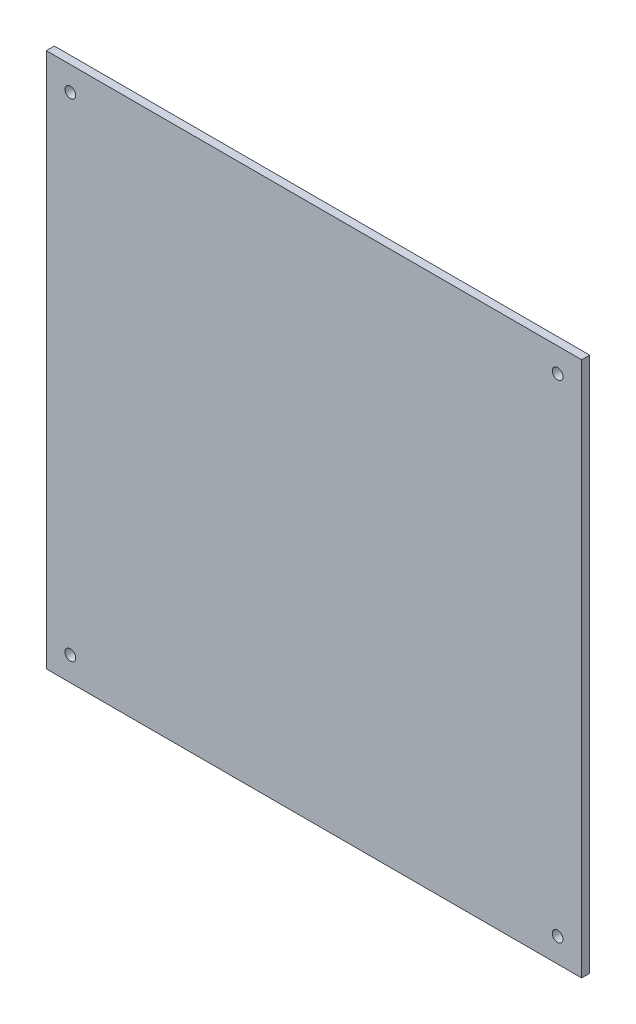
ISO-10303-21;
HEADER;
FILE_DESCRIPTION(('STEP AP214'),'2;1');
FILE_NAME('part.step','',(''),(''),'','','');
FILE_SCHEMA(('AUTOMOTIVE_DESIGN { 1 0 10303 214 1 1 1 1 }'));
ENDSEC;
DATA;
#1=APPLICATION_CONTEXT('core data for automotive mechanical design processes');
#2=APPLICATION_PROTOCOL_DEFINITION('international standard','automotive_design',2000,#1);
#3=PRODUCT_CONTEXT('',#1,'mechanical');
#4=PRODUCT('Part','Part','',(#3));
#5=PRODUCT_RELATED_PRODUCT_CATEGORY('part','',(#4));
#6=PRODUCT_DEFINITION_FORMATION('','',#4);
#7=PRODUCT_DEFINITION_CONTEXT('part definition',#1,'design');
#8=PRODUCT_DEFINITION('design','',#6,#7);
#9=PRODUCT_DEFINITION_SHAPE('','',#8);
#10=(LENGTH_UNIT() NAMED_UNIT(*) SI_UNIT(.MILLI.,.METRE.));
#11=(NAMED_UNIT(*) PLANE_ANGLE_UNIT() SI_UNIT($,.RADIAN.));
#12=(NAMED_UNIT(*) SI_UNIT($,.STERADIAN.) SOLID_ANGLE_UNIT());
#13=UNCERTAINTY_MEASURE_WITH_UNIT(LENGTH_MEASURE(1.E-05),#10,'distance_accuracy_value','');
#14=(GEOMETRIC_REPRESENTATION_CONTEXT(3) GLOBAL_UNCERTAINTY_ASSIGNED_CONTEXT((#13)) GLOBAL_UNIT_ASSIGNED_CONTEXT((#10,
#11,#12)) REPRESENTATION_CONTEXT('',''));
#15=CARTESIAN_POINT('',(0.,0.,0.));
#16=DIRECTION('',(0.,0.,1.));
#17=DIRECTION('',(1.,0.,0.));
#18=AXIS2_PLACEMENT_3D('',#15,#16,#17);
#19=CARTESIAN_POINT('',(0.,0.,3.));
#20=DIRECTION('',(1.,0.,0.));
#21=DIRECTION('',(0.,0.,-1.));
#22=AXIS2_PLACEMENT_3D('',#19,#20,#21);
#23=PLANE('',#22);
#24=DIRECTION('',(0.,-1.,0.));
#25=VECTOR('',#24,1.);
#26=CARTESIAN_POINT('',(0.,0.,0.));
#27=LINE('',#26,#25);
#28=CARTESIAN_POINT('',(0.,200.,0.));
#29=VERTEX_POINT('',#28);
#30=CARTESIAN_POINT('',(0.,0.,0.));
#31=VERTEX_POINT('',#30);
#32=EDGE_CURVE('E96',#29,#31,#27,.T.);
#33=ORIENTED_EDGE('',*,*,#32,.T.);
#34=DIRECTION('',(0.,0.,-1.));
#35=VECTOR('',#34,1.);
#36=CARTESIAN_POINT('',(0.,0.,3.));
#37=LINE('',#36,#35);
#38=CARTESIAN_POINT('',(0.,0.,3.));
#39=VERTEX_POINT('',#38);
#40=EDGE_CURVE('E11',#39,#31,#37,.T.);
#41=ORIENTED_EDGE('',*,*,#40,.F.);
#42=DIRECTION('',(0.,-1.,0.));
#43=VECTOR('',#42,1.);
#44=CARTESIAN_POINT('',(0.,0.,3.));
#45=LINE('',#44,#43);
#46=CARTESIAN_POINT('',(0.,200.,3.));
#47=VERTEX_POINT('',#46);
#48=EDGE_CURVE('E84',#47,#39,#45,.T.);
#49=ORIENTED_EDGE('',*,*,#48,.F.);
#50=DIRECTION('',(0.,0.,-1.));
#51=VECTOR('',#50,1.);
#52=CARTESIAN_POINT('',(0.,200.,3.));
#53=LINE('',#52,#51);
#54=EDGE_CURVE('E92',#47,#29,#53,.T.);
#55=ORIENTED_EDGE('',*,*,#54,.T.);
#56=EDGE_LOOP('',(#33,#41,#49,#55));
#57=FACE_BOUND('',#56,.T.);
#58=ADVANCED_FACE('F33',(#57),#23,.F.);
#59=CARTESIAN_POINT('',(0.,0.,3.));
#60=DIRECTION('',(0.,1.,0.));
#61=DIRECTION('',(0.,0.,1.));
#62=AXIS2_PLACEMENT_3D('',#59,#60,#61);
#63=PLANE('',#62);
#64=DIRECTION('',(1.,0.,0.));
#65=VECTOR('',#64,1.);
#66=CARTESIAN_POINT('',(0.,0.,0.));
#67=LINE('',#66,#65);
#68=CARTESIAN_POINT('',(200.,0.,0.));
#69=VERTEX_POINT('',#68);
#70=EDGE_CURVE('E88',#31,#69,#67,.T.);
#71=ORIENTED_EDGE('',*,*,#70,.T.);
#72=DIRECTION('',(0.,0.,-1.));
#73=VECTOR('',#72,1.);
#74=CARTESIAN_POINT('',(200.,0.,3.));
#75=LINE('',#74,#73);
#76=CARTESIAN_POINT('',(200.,0.,3.));
#77=VERTEX_POINT('',#76);
#78=EDGE_CURVE('E41',#77,#69,#75,.T.);
#79=ORIENTED_EDGE('',*,*,#78,.F.);
#80=DIRECTION('',(1.,0.,0.));
#81=VECTOR('',#80,1.);
#82=CARTESIAN_POINT('',(0.,0.,3.));
#83=LINE('',#82,#81);
#84=EDGE_CURVE('E79',#39,#77,#83,.T.);
#85=ORIENTED_EDGE('',*,*,#84,.F.);
#86=ORIENTED_EDGE('',*,*,#40,.T.);
#87=EDGE_LOOP('',(#71,#79,#85,#86));
#88=FACE_BOUND('',#87,.T.);
#89=ADVANCED_FACE('F87',(#88),#63,.F.);
#90=CARTESIAN_POINT('',(200.,0.,3.));
#91=DIRECTION('',(-1.,0.,0.));
#92=DIRECTION('',(0.,0.,1.));
#93=AXIS2_PLACEMENT_3D('',#90,#91,#92);
#94=PLANE('',#93);
#95=DIRECTION('',(0.,1.,0.));
#96=VECTOR('',#95,1.);
#97=CARTESIAN_POINT('',(200.,0.,0.));
#98=LINE('',#97,#96);
#99=CARTESIAN_POINT('',(200.,200.,0.));
#100=VERTEX_POINT('',#99);
#101=EDGE_CURVE('E66',#69,#100,#98,.T.);
#102=ORIENTED_EDGE('',*,*,#101,.T.);
#103=DIRECTION('',(0.,0.,-1.));
#104=VECTOR('',#103,1.);
#105=CARTESIAN_POINT('',(200.,200.,3.));
#106=LINE('',#105,#104);
#107=CARTESIAN_POINT('',(200.,200.,3.));
#108=VERTEX_POINT('',#107);
#109=EDGE_CURVE('E89',#108,#100,#106,.T.);
#110=ORIENTED_EDGE('',*,*,#109,.F.);
#111=DIRECTION('',(0.,1.,0.));
#112=VECTOR('',#111,1.);
#113=CARTESIAN_POINT('',(200.,0.,3.));
#114=LINE('',#113,#112);
#115=EDGE_CURVE('E82',#77,#108,#114,.T.);
#116=ORIENTED_EDGE('',*,*,#115,.F.);
#117=ORIENTED_EDGE('',*,*,#78,.T.);
#118=EDGE_LOOP('',(#102,#110,#116,#117));
#119=FACE_BOUND('',#118,.T.);
#120=ADVANCED_FACE('F90',(#119),#94,.F.);
#121=CARTESIAN_POINT('',(0.,200.,3.));
#122=DIRECTION('',(0.,-1.,0.));
#123=DIRECTION('',(0.,0.,-1.));
#124=AXIS2_PLACEMENT_3D('',#121,#122,#123);
#125=PLANE('',#124);
#126=DIRECTION('',(-1.,0.,0.));
#127=VECTOR('',#126,1.);
#128=CARTESIAN_POINT('',(0.,200.,0.));
#129=LINE('',#128,#127);
#130=EDGE_CURVE('E72',#100,#29,#129,.T.);
#131=ORIENTED_EDGE('',*,*,#130,.T.);
#132=ORIENTED_EDGE('',*,*,#54,.F.);
#133=DIRECTION('',(-1.,0.,0.));
#134=VECTOR('',#133,1.);
#135=CARTESIAN_POINT('',(0.,200.,3.));
#136=LINE('',#135,#134);
#137=EDGE_CURVE('E49',#108,#47,#136,.T.);
#138=ORIENTED_EDGE('',*,*,#137,.F.);
#139=ORIENTED_EDGE('',*,*,#109,.T.);
#140=EDGE_LOOP('',(#131,#132,#138,#139));
#141=FACE_BOUND('',#140,.T.);
#142=ADVANCED_FACE('F104',(#141),#125,.F.);
#143=CARTESIAN_POINT('',(0.,0.,3.));
#144=DIRECTION('',(0.,0.,-1.));
#145=DIRECTION('',(-1.,0.,0.));
#146=AXIS2_PLACEMENT_3D('',#143,#144,#145);
#147=PLANE('',#146);
#148=CARTESIAN_POINT('',(191.,191.,3.));
#149=DIRECTION('',(0.,0.,-1.));
#150=DIRECTION('',(-1.,0.,0.));
#151=AXIS2_PLACEMENT_3D('',#148,#149,#150);
#152=CIRCLE('',#151,2.);
#153=CARTESIAN_POINT('',(189.,191.,3.));
#154=VERTEX_POINT('',#153);
#155=EDGE_CURVE('E115',#154,#154,#152,.T.);
#156=ORIENTED_EDGE('',*,*,#155,.T.);
#157=EDGE_LOOP('',(#156));
#158=FACE_BOUND('',#157,.T.);
#159=CARTESIAN_POINT('',(191.,9.00000000000001,3.));
#160=DIRECTION('',(0.,0.,-1.));
#161=DIRECTION('',(-1.,0.,0.));
#162=AXIS2_PLACEMENT_3D('',#159,#160,#161);
#163=CIRCLE('',#162,2.);
#164=CARTESIAN_POINT('',(189.,9.00000000000001,3.));
#165=VERTEX_POINT('',#164);
#166=EDGE_CURVE('E118',#165,#165,#163,.T.);
#167=ORIENTED_EDGE('',*,*,#166,.T.);
#168=EDGE_LOOP('',(#167));
#169=FACE_BOUND('',#168,.T.);
#170=CARTESIAN_POINT('',(9.00000000000006,8.99999999999999,3.));
#171=DIRECTION('',(0.,0.,-1.));
#172=DIRECTION('',(-1.,0.,0.));
#173=AXIS2_PLACEMENT_3D('',#170,#171,#172);
#174=CIRCLE('',#173,2.);
#175=CARTESIAN_POINT('',(7.00000000000006,8.99999999999999,3.));
#176=VERTEX_POINT('',#175);
#177=EDGE_CURVE('E121',#176,#176,#174,.T.);
#178=ORIENTED_EDGE('',*,*,#177,.T.);
#179=EDGE_LOOP('',(#178));
#180=FACE_BOUND('',#179,.T.);
#181=CARTESIAN_POINT('',(9.00000000000001,191.,3.));
#182=DIRECTION('',(0.,0.,-1.));
#183=DIRECTION('',(-1.,0.,0.));
#184=AXIS2_PLACEMENT_3D('',#181,#182,#183);
#185=CIRCLE('',#184,2.);
#186=CARTESIAN_POINT('',(7.00000000000001,191.,3.));
#187=VERTEX_POINT('',#186);
#188=EDGE_CURVE('E99',#187,#187,#185,.T.);
#189=ORIENTED_EDGE('',*,*,#188,.T.);
#190=EDGE_LOOP('',(#189));
#191=FACE_BOUND('',#190,.T.);
#192=ORIENTED_EDGE('',*,*,#48,.T.);
#193=ORIENTED_EDGE('',*,*,#84,.T.);
#194=ORIENTED_EDGE('',*,*,#115,.T.);
#195=ORIENTED_EDGE('',*,*,#137,.T.);
#196=EDGE_LOOP('',(#192,#193,#194,#195));
#197=FACE_BOUND('',#196,.T.);
#198=ADVANCED_FACE('F80',(#158,#169,#180,#191,#197),#147,.F.);
#199=CARTESIAN_POINT('',(0.,0.,0.));
#200=DIRECTION('',(0.,0.,-1.));
#201=DIRECTION('',(-1.,0.,0.));
#202=AXIS2_PLACEMENT_3D('',#199,#200,#201);
#203=PLANE('',#202);
#204=CARTESIAN_POINT('',(191.,191.,0.));
#205=DIRECTION('',(0.,0.,1.));
#206=DIRECTION('',(-1.,0.,0.));
#207=AXIS2_PLACEMENT_3D('',#204,#205,#206);
#208=CIRCLE('',#207,2.);
#209=CARTESIAN_POINT('',(189.,191.,0.));
#210=VERTEX_POINT('',#209);
#211=EDGE_CURVE('E124',#210,#210,#208,.T.);
#212=ORIENTED_EDGE('',*,*,#211,.T.);
#213=EDGE_LOOP('',(#212));
#214=FACE_BOUND('',#213,.T.);
#215=CARTESIAN_POINT('',(191.,9.00000000000001,0.));
#216=DIRECTION('',(0.,0.,1.));
#217=DIRECTION('',(1.,0.,0.));
#218=AXIS2_PLACEMENT_3D('',#215,#216,#217);
#219=CIRCLE('',#218,2.);
#220=CARTESIAN_POINT('',(193.,9.00000000000001,0.));
#221=VERTEX_POINT('',#220);
#222=EDGE_CURVE('E128',#221,#221,#219,.T.);
#223=ORIENTED_EDGE('',*,*,#222,.T.);
#224=EDGE_LOOP('',(#223));
#225=FACE_BOUND('',#224,.T.);
#226=CARTESIAN_POINT('',(9.00000000000006,8.99999999999999,0.));
#227=DIRECTION('',(0.,0.,1.));
#228=DIRECTION('',(-1.,0.,0.));
#229=AXIS2_PLACEMENT_3D('',#226,#227,#228);
#230=CIRCLE('',#229,2.);
#231=CARTESIAN_POINT('',(7.00000000000006,8.99999999999999,0.));
#232=VERTEX_POINT('',#231);
#233=EDGE_CURVE('E125',#232,#232,#230,.T.);
#234=ORIENTED_EDGE('',*,*,#233,.T.);
#235=EDGE_LOOP('',(#234));
#236=FACE_BOUND('',#235,.T.);
#237=CARTESIAN_POINT('',(9.00000000000001,191.,0.));
#238=DIRECTION('',(0.,0.,1.));
#239=DIRECTION('',(1.,0.,0.));
#240=AXIS2_PLACEMENT_3D('',#237,#238,#239);
#241=CIRCLE('',#240,2.);
#242=CARTESIAN_POINT('',(11.,191.,0.));
#243=VERTEX_POINT('',#242);
#244=EDGE_CURVE('E112',#243,#243,#241,.T.);
#245=ORIENTED_EDGE('',*,*,#244,.T.);
#246=EDGE_LOOP('',(#245));
#247=FACE_BOUND('',#246,.T.);
#248=ORIENTED_EDGE('',*,*,#32,.F.);
#249=ORIENTED_EDGE('',*,*,#130,.F.);
#250=ORIENTED_EDGE('',*,*,#101,.F.);
#251=ORIENTED_EDGE('',*,*,#70,.F.);
#252=EDGE_LOOP('',(#248,#249,#250,#251));
#253=FACE_BOUND('',#252,.T.);
#254=ADVANCED_FACE('F107',(#214,#225,#236,#247,#253),#203,.T.);
#255=CARTESIAN_POINT('',(9.00000000000001,191.,0.));
#256=DIRECTION('',(0.,0.,1.));
#257=DIRECTION('',(1.,0.,0.));
#258=AXIS2_PLACEMENT_3D('',#255,#256,#257);
#259=CYLINDRICAL_SURFACE('',#258,2.);
#260=ORIENTED_EDGE('',*,*,#244,.F.);
#261=EDGE_LOOP('',(#260));
#262=FACE_BOUND('',#261,.T.);
#263=ORIENTED_EDGE('',*,*,#188,.F.);
#264=EDGE_LOOP('',(#263));
#265=FACE_BOUND('',#264,.T.);
#266=ADVANCED_FACE('F152',(#262,#265),#259,.F.);
#267=CARTESIAN_POINT('',(9.00000000000006,8.99999999999999,0.));
#268=DIRECTION('',(0.,0.,1.));
#269=DIRECTION('',(1.,0.,0.));
#270=AXIS2_PLACEMENT_3D('',#267,#268,#269);
#271=CYLINDRICAL_SURFACE('',#270,2.);
#272=ORIENTED_EDGE('',*,*,#233,.F.);
#273=EDGE_LOOP('',(#272));
#274=FACE_BOUND('',#273,.T.);
#275=ORIENTED_EDGE('',*,*,#177,.F.);
#276=EDGE_LOOP('',(#275));
#277=FACE_BOUND('',#276,.T.);
#278=ADVANCED_FACE('F154',(#274,#277),#271,.F.);
#279=CARTESIAN_POINT('',(191.,9.00000000000001,0.));
#280=DIRECTION('',(0.,0.,1.));
#281=DIRECTION('',(1.,0.,0.));
#282=AXIS2_PLACEMENT_3D('',#279,#280,#281);
#283=CYLINDRICAL_SURFACE('',#282,2.);
#284=ORIENTED_EDGE('',*,*,#222,.F.);
#285=EDGE_LOOP('',(#284));
#286=FACE_BOUND('',#285,.T.);
#287=ORIENTED_EDGE('',*,*,#166,.F.);
#288=EDGE_LOOP('',(#287));
#289=FACE_BOUND('',#288,.T.);
#290=ADVANCED_FACE('F139',(#286,#289),#283,.F.);
#291=CARTESIAN_POINT('',(191.,191.,0.));
#292=DIRECTION('',(0.,0.,1.));
#293=DIRECTION('',(1.,0.,0.));
#294=AXIS2_PLACEMENT_3D('',#291,#292,#293);
#295=CYLINDRICAL_SURFACE('',#294,2.);
#296=ORIENTED_EDGE('',*,*,#211,.F.);
#297=EDGE_LOOP('',(#296));
#298=FACE_BOUND('',#297,.T.);
#299=ORIENTED_EDGE('',*,*,#155,.F.);
#300=EDGE_LOOP('',(#299));
#301=FACE_BOUND('',#300,.T.);
#302=ADVANCED_FACE('F136',(#298,#301),#295,.F.);
#303=CLOSED_SHELL('',(#58,#89,#120,#142,#198,#254,#266,#278,#290,#302));
#304=MANIFOLD_SOLID_BREP('B2',#303);
#305=ADVANCED_BREP_SHAPE_REPRESENTATION('',(#18,#304),#14);
#306=SHAPE_DEFINITION_REPRESENTATION(#9,#305);
ENDSEC;
END-ISO-10303-21;
